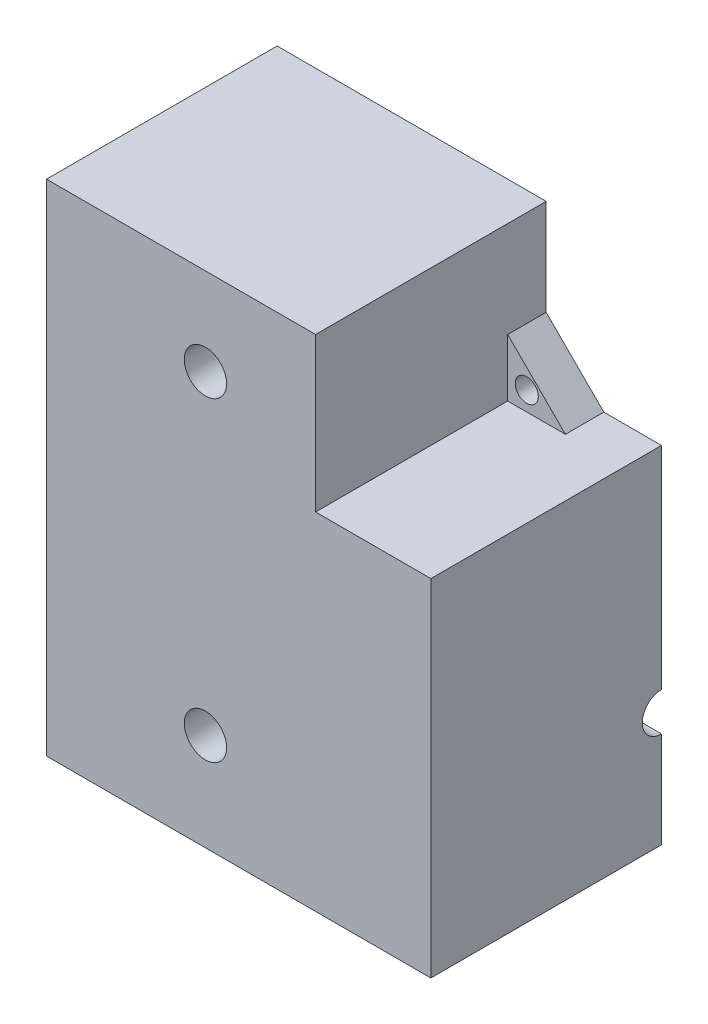
ISO-10303-21;
HEADER;
FILE_DESCRIPTION(('STEP AP214'),'2;1');
FILE_NAME('part.step','',(''),(''),'','','');
FILE_SCHEMA(('AUTOMOTIVE_DESIGN { 1 0 10303 214 1 1 1 1 }'));
ENDSEC;
DATA;
#1=APPLICATION_CONTEXT('core data for automotive mechanical design processes');
#2=APPLICATION_PROTOCOL_DEFINITION('international standard','automotive_design',2000,#1);
#3=PRODUCT_CONTEXT('',#1,'mechanical');
#4=PRODUCT('Part','Part','',(#3));
#5=PRODUCT_RELATED_PRODUCT_CATEGORY('part','',(#4));
#6=PRODUCT_DEFINITION_FORMATION('','',#4);
#7=PRODUCT_DEFINITION_CONTEXT('part definition',#1,'design');
#8=PRODUCT_DEFINITION('design','',#6,#7);
#9=PRODUCT_DEFINITION_SHAPE('','',#8);
#10=(LENGTH_UNIT() NAMED_UNIT(*) SI_UNIT(.MILLI.,.METRE.));
#11=(NAMED_UNIT(*) PLANE_ANGLE_UNIT() SI_UNIT($,.RADIAN.));
#12=(NAMED_UNIT(*) SI_UNIT($,.STERADIAN.) SOLID_ANGLE_UNIT());
#13=UNCERTAINTY_MEASURE_WITH_UNIT(LENGTH_MEASURE(1.E-05),#10,'distance_accuracy_value','');
#14=(GEOMETRIC_REPRESENTATION_CONTEXT(3) GLOBAL_UNCERTAINTY_ASSIGNED_CONTEXT((#13)) GLOBAL_UNIT_ASSIGNED_CONTEXT((#10,
#11,#12)) REPRESENTATION_CONTEXT('',''));
#15=CARTESIAN_POINT('',(0.,0.,0.));
#16=DIRECTION('',(0.,0.,1.));
#17=DIRECTION('',(1.,0.,0.));
#18=AXIS2_PLACEMENT_3D('',#15,#16,#17);
#19=CARTESIAN_POINT('',(-62.6704468378535,-90.6576669308982,5.));
#20=DIRECTION('',(0.,0.,1.));
#21=DIRECTION('',(1.,0.,0.));
#22=AXIS2_PLACEMENT_3D('',#19,#20,#21);
#23=PLANE('',#22);
#24=DIRECTION('',(0.,1.,0.));
#25=VECTOR('',#24,1.);
#26=CARTESIAN_POINT('',(-27.6704468378535,-25.6576669308982,5.));
#27=LINE('',#26,#25);
#28=CARTESIAN_POINT('',(-27.6704468378535,-45.6576669308982,5.));
#29=VERTEX_POINT('',#28);
#30=CARTESIAN_POINT('',(-27.6704468378535,-38.1576669308982,5.));
#31=VERTEX_POINT('',#30);
#32=EDGE_CURVE('E257',#29,#31,#27,.T.);
#33=ORIENTED_EDGE('',*,*,#32,.F.);
#34=DIRECTION('',(-1.,0.,0.));
#35=VECTOR('',#34,1.);
#36=CARTESIAN_POINT('',(-27.6704468378535,-45.6576669308982,5.));
#37=LINE('',#36,#35);
#38=CARTESIAN_POINT('',(-20.1704468378535,-45.6576669308982,5.));
#39=VERTEX_POINT('',#38);
#40=EDGE_CURVE('E360',#39,#29,#37,.T.);
#41=ORIENTED_EDGE('',*,*,#40,.F.);
#42=DIRECTION('',(-0.707106781186548,0.707106781186548,0.));
#43=VECTOR('',#42,1.);
#44=CARTESIAN_POINT('',(-27.6704468378535,-38.1576669308982,5.));
#45=LINE('',#44,#43);
#46=EDGE_CURVE('E217',#39,#31,#45,.T.);
#47=ORIENTED_EDGE('',*,*,#46,.T.);
#48=EDGE_LOOP('',(#33,#41,#47));
#49=FACE_BOUND('',#48,.T.);
#50=CARTESIAN_POINT('',(-25.1955731037006,-43.1827931967453,5.));
#51=DIRECTION('',(0.,0.,1.));
#52=DIRECTION('',(1.,0.,0.));
#53=AXIS2_PLACEMENT_3D('',#50,#51,#52);
#54=CIRCLE('',#53,1.5);
#55=CARTESIAN_POINT('',(-23.6955731037006,-43.1827931967453,5.));
#56=VERTEX_POINT('',#55);
#57=EDGE_CURVE('E247',#56,#56,#54,.T.);
#58=ORIENTED_EDGE('',*,*,#57,.F.);
#59=EDGE_LOOP('',(#58));
#60=FACE_BOUND('',#59,.T.);
#61=ADVANCED_FACE('F30',(#49,#60),#23,.T.);
#62=DIRECTION('',(1.,0.,0.));
#63=VECTOR('',#62,1.);
#64=CARTESIAN_POINT('',(-62.6704468378535,-90.6576669308982,5.));
#65=LINE('',#64,#63);
#66=CARTESIAN_POINT('',(-42.6704468378535,-90.6576669308982,5.));
#67=VERTEX_POINT('',#66);
#68=CARTESIAN_POINT('',(-32.6704468378535,-90.6576669308982,5.));
#69=VERTEX_POINT('',#68);
#70=EDGE_CURVE('E295',#67,#69,#65,.T.);
#71=ORIENTED_EDGE('',*,*,#70,.F.);
#72=DIRECTION('',(0.637046062357118,-0.770825735452113,0.));
#73=VECTOR('',#72,1.);
#74=CARTESIAN_POINT('',(-42.6704468378535,-90.6576669308982,5.));
#75=LINE('',#74,#73);
#76=CARTESIAN_POINT('',(-37.6704468378535,-96.7076669308982,5.));
#77=VERTEX_POINT('',#76);
#78=EDGE_CURVE('E388',#67,#77,#75,.T.);
#79=ORIENTED_EDGE('',*,*,#78,.T.);
#80=DIRECTION('',(0.637046062357118,0.770825735452113,0.));
#81=VECTOR('',#80,1.);
#82=CARTESIAN_POINT('',(-32.6704468378535,-90.6576669308982,5.));
#83=LINE('',#82,#81);
#84=EDGE_CURVE('E378',#77,#69,#83,.T.);
#85=ORIENTED_EDGE('',*,*,#84,.T.);
#86=EDGE_LOOP('',(#71,#79,#85));
#87=FACE_BOUND('',#86,.T.);
#88=CARTESIAN_POINT('',(-37.6704468378535,-93.2076669308982,5.));
#89=DIRECTION('',(0.,0.,1.));
#90=DIRECTION('',(1.,0.,0.));
#91=AXIS2_PLACEMENT_3D('',#88,#89,#90);
#92=CIRCLE('',#91,1.5);
#93=CARTESIAN_POINT('',(-36.1704468378535,-93.2076669308982,5.));
#94=VERTEX_POINT('',#93);
#95=EDGE_CURVE('E251',#94,#94,#92,.T.);
#96=ORIENTED_EDGE('',*,*,#95,.F.);
#97=EDGE_LOOP('',(#96));
#98=FACE_BOUND('',#97,.T.);
#99=ADVANCED_FACE('F436',(#87,#98),#23,.T.);
#100=CARTESIAN_POINT('',(-62.6704468378535,-53.1576669308982,5.));
#101=DIRECTION('',(0.637121756226139,-0.770763172280124,0.));
#102=DIRECTION('',(0.770763172280124,0.637121756226139,0.));
#103=AXIS2_PLACEMENT_3D('',#100,#101,#102);
#104=PLANE('',#103);
#105=DIRECTION('',(-0.770763172280124,-0.637121756226139,0.));
#106=VECTOR('',#105,1.);
#107=CARTESIAN_POINT('',(-62.6704468378535,-53.1576669308982,0.));
#108=LINE('',#107,#106);
#109=CARTESIAN_POINT('',(-62.6704468378535,-53.1576669308982,0.));
#110=VERTEX_POINT('',#109);
#111=CARTESIAN_POINT('',(-68.719237078871,-58.1576669308982,0.));
#112=VERTEX_POINT('',#111);
#113=EDGE_CURVE('E273',#110,#112,#108,.T.);
#114=ORIENTED_EDGE('',*,*,#113,.T.);
#115=DIRECTION('',(0.,0.,-1.));
#116=VECTOR('',#115,1.);
#117=CARTESIAN_POINT('',(-68.719237078871,-58.1576669308982,5.));
#118=LINE('',#117,#116);
#119=CARTESIAN_POINT('',(-68.719237078871,-58.1576669308982,5.));
#120=VERTEX_POINT('',#119);
#121=EDGE_CURVE('E235',#120,#112,#118,.T.);
#122=ORIENTED_EDGE('',*,*,#121,.F.);
#123=DIRECTION('',(-0.770763172280124,-0.637121756226139,0.));
#124=VECTOR('',#123,1.);
#125=CARTESIAN_POINT('',(-62.6704468378535,-53.1576669308982,5.));
#126=LINE('',#125,#124);
#127=CARTESIAN_POINT('',(-62.6704468378535,-53.1576669308982,5.));
#128=VERTEX_POINT('',#127);
#129=EDGE_CURVE('E212',#128,#120,#126,.T.);
#130=ORIENTED_EDGE('',*,*,#129,.F.);
#131=DIRECTION('',(0.,0.,-1.));
#132=VECTOR('',#131,1.);
#133=CARTESIAN_POINT('',(-62.6704468378535,-53.1576669308982,5.));
#134=LINE('',#133,#132);
#135=EDGE_CURVE('E238',#128,#110,#134,.T.);
#136=ORIENTED_EDGE('',*,*,#135,.T.);
#137=EDGE_LOOP('',(#114,#122,#130,#136));
#138=FACE_BOUND('',#137,.T.);
#139=ADVANCED_FACE('F32',(#138),#104,.F.);
#140=CARTESIAN_POINT('',(-68.719237078871,-58.1576669308982,5.));
#141=DIRECTION('',(0.637121756226137,0.770763172280126,0.));
#142=DIRECTION('',(-0.770763172280126,0.637121756226137,0.));
#143=AXIS2_PLACEMENT_3D('',#140,#141,#142);
#144=PLANE('',#143);
#145=DIRECTION('',(0.770763172280126,-0.637121756226137,0.));
#146=VECTOR('',#145,1.);
#147=CARTESIAN_POINT('',(-68.719237078871,-58.1576669308982,0.));
#148=LINE('',#147,#146);
#149=CARTESIAN_POINT('',(-62.6704468378535,-63.1576669308982,0.));
#150=VERTEX_POINT('',#149);
#151=EDGE_CURVE('E275',#112,#150,#148,.T.);
#152=ORIENTED_EDGE('',*,*,#151,.T.);
#153=DIRECTION('',(0.,0.,-1.));
#154=VECTOR('',#153,1.);
#155=CARTESIAN_POINT('',(-62.6704468378535,-63.1576669308982,5.));
#156=LINE('',#155,#154);
#157=CARTESIAN_POINT('',(-62.6704468378535,-63.1576669308982,5.));
#158=VERTEX_POINT('',#157);
#159=EDGE_CURVE('E234',#158,#150,#156,.T.);
#160=ORIENTED_EDGE('',*,*,#159,.F.);
#161=DIRECTION('',(0.770763172280126,-0.637121756226137,0.));
#162=VECTOR('',#161,1.);
#163=CARTESIAN_POINT('',(-68.719237078871,-58.1576669308982,5.));
#164=LINE('',#163,#162);
#165=EDGE_CURVE('E386',#120,#158,#164,.T.);
#166=ORIENTED_EDGE('',*,*,#165,.F.);
#167=ORIENTED_EDGE('',*,*,#121,.T.);
#168=EDGE_LOOP('',(#152,#160,#166,#167));
#169=FACE_BOUND('',#168,.T.);
#170=ADVANCED_FACE('F498',(#169),#144,.F.);
#171=CARTESIAN_POINT('',(-62.6704468378535,-90.6576669308982,5.));
#172=DIRECTION('',(1.,0.,0.));
#173=DIRECTION('',(0.,0.,-1.));
#174=AXIS2_PLACEMENT_3D('',#171,#172,#173);
#175=PLANE('',#174);
#176=DIRECTION('',(0.,-1.,0.));
#177=VECTOR('',#176,1.);
#178=CARTESIAN_POINT('',(-62.6704468378535,-90.6576669308982,0.));
#179=LINE('',#178,#177);
#180=CARTESIAN_POINT('',(-62.6704468378535,-90.6576669308982,0.));
#181=VERTEX_POINT('',#180);
#182=EDGE_CURVE('E277',#150,#181,#179,.T.);
#183=ORIENTED_EDGE('',*,*,#182,.T.);
#184=DIRECTION('',(0.,0.,-1.));
#185=VECTOR('',#184,1.);
#186=CARTESIAN_POINT('',(-62.6704468378535,-90.6576669308982,5.));
#187=LINE('',#186,#185);
#188=CARTESIAN_POINT('',(-62.6704468378535,-90.6576669308982,30.));
#189=VERTEX_POINT('',#188);
#190=EDGE_CURVE('E231',#189,#181,#187,.T.);
#191=ORIENTED_EDGE('',*,*,#190,.F.);
#192=DIRECTION('',(0.,-1.,0.));
#193=VECTOR('',#192,1.);
#194=CARTESIAN_POINT('',(-62.6704468378535,-25.6576669308982,30.));
#195=LINE('',#194,#193);
#196=CARTESIAN_POINT('',(-62.6704468378535,-25.6576669308982,30.));
#197=VERTEX_POINT('',#196);
#198=EDGE_CURVE('E335',#197,#189,#195,.T.);
#199=ORIENTED_EDGE('',*,*,#198,.F.);
#200=DIRECTION('',(0.,0.,-1.));
#201=VECTOR('',#200,1.);
#202=CARTESIAN_POINT('',(-62.6704468378535,-25.6576669308982,5.));
#203=LINE('',#202,#201);
#204=CARTESIAN_POINT('',(-62.6704468378535,-25.6576669308982,0.));
#205=VERTEX_POINT('',#204);
#206=EDGE_CURVE('E213',#197,#205,#203,.T.);
#207=ORIENTED_EDGE('',*,*,#206,.T.);
#208=DIRECTION('',(0.,-1.,0.));
#209=VECTOR('',#208,1.);
#210=CARTESIAN_POINT('',(-62.6704468378535,-25.6576669308982,0.));
#211=LINE('',#210,#209);
#212=EDGE_CURVE('E242',#205,#110,#211,.T.);
#213=ORIENTED_EDGE('',*,*,#212,.T.);
#214=ORIENTED_EDGE('',*,*,#135,.F.);
#215=DIRECTION('',(0.,-1.,0.));
#216=VECTOR('',#215,1.);
#217=CARTESIAN_POINT('',(-62.6704468378535,-25.6576669308982,5.));
#218=LINE('',#217,#216);
#219=EDGE_CURVE('E369',#128,#158,#218,.T.);
#220=ORIENTED_EDGE('',*,*,#219,.T.);
#221=ORIENTED_EDGE('',*,*,#159,.T.);
#222=EDGE_LOOP('',(#183,#191,#199,#207,#213,#214,#220,#221));
#223=FACE_BOUND('',#222,.T.);
#224=ADVANCED_FACE('F413',(#223),#175,.F.);
#225=CARTESIAN_POINT('',(-42.6704468378535,-90.6576669308982,5.));
#226=DIRECTION('',(0.770825735452113,0.637046062357118,0.));
#227=DIRECTION('',(-0.637046062357118,0.770825735452113,0.));
#228=AXIS2_PLACEMENT_3D('',#225,#226,#227);
#229=PLANE('',#228);
#230=DIRECTION('',(0.637046062357118,-0.770825735452113,0.));
#231=VECTOR('',#230,1.);
#232=CARTESIAN_POINT('',(-42.6704468378535,-90.6576669308982,0.));
#233=LINE('',#232,#231);
#234=CARTESIAN_POINT('',(-42.6704468378535,-90.6576669308982,0.));
#235=VERTEX_POINT('',#234);
#236=CARTESIAN_POINT('',(-37.6704468378535,-96.7076669308982,0.));
#237=VERTEX_POINT('',#236);
#238=EDGE_CURVE('E281',#235,#237,#233,.T.);
#239=ORIENTED_EDGE('',*,*,#238,.T.);
#240=DIRECTION('',(0.,0.,-1.));
#241=VECTOR('',#240,1.);
#242=CARTESIAN_POINT('',(-37.6704468378535,-96.7076669308982,5.));
#243=LINE('',#242,#241);
#244=EDGE_CURVE('E227',#77,#237,#243,.T.);
#245=ORIENTED_EDGE('',*,*,#244,.F.);
#246=ORIENTED_EDGE('',*,*,#78,.F.);
#247=DIRECTION('',(0.,0.,-1.));
#248=VECTOR('',#247,1.);
#249=CARTESIAN_POINT('',(-42.6704468378535,-90.6576669308982,5.));
#250=LINE('',#249,#248);
#251=EDGE_CURVE('E230',#67,#235,#250,.T.);
#252=ORIENTED_EDGE('',*,*,#251,.T.);
#253=EDGE_LOOP('',(#239,#245,#246,#252));
#254=FACE_BOUND('',#253,.T.);
#255=ADVANCED_FACE('F516',(#254),#229,.F.);
#256=CARTESIAN_POINT('',(-32.6704468378535,-90.6576669308982,5.));
#257=DIRECTION('',(-0.770825735452113,0.637046062357118,0.));
#258=DIRECTION('',(-0.637046062357118,-0.770825735452113,0.));
#259=AXIS2_PLACEMENT_3D('',#256,#257,#258);
#260=PLANE('',#259);
#261=DIRECTION('',(0.637046062357118,0.770825735452113,0.));
#262=VECTOR('',#261,1.);
#263=CARTESIAN_POINT('',(-32.6704468378535,-90.6576669308982,0.));
#264=LINE('',#263,#262);
#265=CARTESIAN_POINT('',(-32.6704468378535,-90.6576669308982,0.));
#266=VERTEX_POINT('',#265);
#267=EDGE_CURVE('E201',#237,#266,#264,.T.);
#268=ORIENTED_EDGE('',*,*,#267,.T.);
#269=DIRECTION('',(0.,0.,-1.));
#270=VECTOR('',#269,1.);
#271=CARTESIAN_POINT('',(-32.6704468378535,-90.6576669308982,5.));
#272=LINE('',#271,#270);
#273=EDGE_CURVE('E226',#69,#266,#272,.T.);
#274=ORIENTED_EDGE('',*,*,#273,.F.);
#275=ORIENTED_EDGE('',*,*,#84,.F.);
#276=ORIENTED_EDGE('',*,*,#244,.T.);
#277=EDGE_LOOP('',(#268,#274,#275,#276));
#278=FACE_BOUND('',#277,.T.);
#279=ADVANCED_FACE('F286',(#278),#260,.F.);
#280=CARTESIAN_POINT('',(-12.6704468378535,-90.6576669308982,5.));
#281=DIRECTION('',(0.,1.,0.));
#282=DIRECTION('',(0.,0.,1.));
#283=AXIS2_PLACEMENT_3D('',#280,#281,#282);
#284=PLANE('',#283);
#285=DIRECTION('',(1.,0.,0.));
#286=VECTOR('',#285,1.);
#287=CARTESIAN_POINT('',(-12.6704468378535,-90.6576669308982,0.));
#288=LINE('',#287,#286);
#289=CARTESIAN_POINT('',(-12.6704468378535,-90.6576669308982,0.));
#290=VERTEX_POINT('',#289);
#291=EDGE_CURVE('E199',#266,#290,#288,.T.);
#292=ORIENTED_EDGE('',*,*,#291,.T.);
#293=DIRECTION('',(0.,0.,-1.));
#294=VECTOR('',#293,1.);
#295=CARTESIAN_POINT('',(-12.6704468378535,-90.6576669308982,5.));
#296=LINE('',#295,#294);
#297=CARTESIAN_POINT('',(-12.6704468378535,-90.6576669308982,30.));
#298=VERTEX_POINT('',#297);
#299=EDGE_CURVE('E223',#298,#290,#296,.T.);
#300=ORIENTED_EDGE('',*,*,#299,.F.);
#301=DIRECTION('',(1.,0.,0.));
#302=VECTOR('',#301,1.);
#303=CARTESIAN_POINT('',(-62.6704468378535,-90.6576669308982,30.));
#304=LINE('',#303,#302);
#305=EDGE_CURVE('E338',#189,#298,#304,.T.);
#306=ORIENTED_EDGE('',*,*,#305,.F.);
#307=ORIENTED_EDGE('',*,*,#190,.T.);
#308=DIRECTION('',(1.,0.,0.));
#309=VECTOR('',#308,1.);
#310=CARTESIAN_POINT('',(-62.6704468378535,-90.6576669308982,0.));
#311=LINE('',#310,#309);
#312=EDGE_CURVE('E279',#181,#235,#311,.T.);
#313=ORIENTED_EDGE('',*,*,#312,.T.);
#314=ORIENTED_EDGE('',*,*,#251,.F.);
#315=ORIENTED_EDGE('',*,*,#70,.T.);
#316=ORIENTED_EDGE('',*,*,#273,.T.);
#317=EDGE_LOOP('',(#292,#300,#306,#307,#313,#314,#315,#316));
#318=FACE_BOUND('',#317,.T.);
#319=ADVANCED_FACE('F293',(#318),#284,.F.);
#320=CARTESIAN_POINT('',(-12.6704468378535,-90.6576669308982,5.));
#321=DIRECTION('',(-1.,0.,0.));
#322=DIRECTION('',(0.,0.,1.));
#323=AXIS2_PLACEMENT_3D('',#320,#321,#322);
#324=PLANE('',#323);
#325=DIRECTION('',(0.,1.,0.));
#326=VECTOR('',#325,1.);
#327=CARTESIAN_POINT('',(-12.6704468378535,-90.6576669308982,0.));
#328=LINE('',#327,#326);
#329=CARTESIAN_POINT('',(-12.6704468378535,-78.15766693,0.));
#330=VERTEX_POINT('',#329);
#331=EDGE_CURVE('E191',#290,#330,#328,.T.);
#332=ORIENTED_EDGE('',*,*,#331,.T.);
#333=CARTESIAN_POINT('',(-12.6704468378535,-75.65766693,0.));
#334=DIRECTION('',(1.,0.,0.));
#335=DIRECTION('',(0.,0.,-1.));
#336=AXIS2_PLACEMENT_3D('',#333,#334,#335);
#337=CIRCLE('',#336,2.5);
#338=CARTESIAN_POINT('',(-12.6704468378535,-73.15766693,0.));
#339=VERTEX_POINT('',#338);
#340=EDGE_CURVE('E179',#339,#330,#337,.T.);
#341=ORIENTED_EDGE('',*,*,#340,.F.);
#342=CARTESIAN_POINT('',(-12.6704468378535,-45.6576669308982,0.));
#343=VERTEX_POINT('',#342);
#344=EDGE_CURVE('E187',#339,#343,#328,.T.);
#345=ORIENTED_EDGE('',*,*,#344,.T.);
#346=DIRECTION('',(0.,0.,-1.));
#347=VECTOR('',#346,1.);
#348=CARTESIAN_POINT('',(-12.6704468378535,-45.6576669308982,5.));
#349=LINE('',#348,#347);
#350=CARTESIAN_POINT('',(-12.6704468378535,-45.6576669308982,30.));
#351=VERTEX_POINT('',#350);
#352=EDGE_CURVE('E221',#351,#343,#349,.T.);
#353=ORIENTED_EDGE('',*,*,#352,.F.);
#354=DIRECTION('',(0.,1.,0.));
#355=VECTOR('',#354,1.);
#356=CARTESIAN_POINT('',(-12.6704468378535,-90.6576669308982,30.));
#357=LINE('',#356,#355);
#358=EDGE_CURVE('E341',#298,#351,#357,.T.);
#359=ORIENTED_EDGE('',*,*,#358,.F.);
#360=ORIENTED_EDGE('',*,*,#299,.T.);
#361=EDGE_LOOP('',(#332,#341,#345,#353,#359,#360));
#362=FACE_BOUND('',#361,.T.);
#363=ADVANCED_FACE('F186',(#362),#324,.F.);
#364=CARTESIAN_POINT('',(-12.6704468378535,-45.6576669308982,5.));
#365=DIRECTION('',(0.,-1.,0.));
#366=DIRECTION('',(1.,0.,0.));
#367=AXIS2_PLACEMENT_3D('',#364,#365,#366);
#368=PLANE('',#367);
#369=DIRECTION('',(-1.,0.,0.));
#370=VECTOR('',#369,1.);
#371=CARTESIAN_POINT('',(-12.6704468378535,-45.6576669308982,0.));
#372=LINE('',#371,#370);
#373=CARTESIAN_POINT('',(-20.1704468378535,-45.6576669308982,0.));
#374=VERTEX_POINT('',#373);
#375=EDGE_CURVE('E198',#343,#374,#372,.T.);
#376=ORIENTED_EDGE('',*,*,#375,.T.);
#377=DIRECTION('',(0.,0.,-1.));
#378=VECTOR('',#377,1.);
#379=CARTESIAN_POINT('',(-20.1704468378535,-45.6576669308982,5.));
#380=LINE('',#379,#378);
#381=EDGE_CURVE('E224',#39,#374,#380,.T.);
#382=ORIENTED_EDGE('',*,*,#381,.F.);
#383=ORIENTED_EDGE('',*,*,#40,.T.);
#384=DIRECTION('',(0.,0.,-1.));
#385=VECTOR('',#384,1.);
#386=CARTESIAN_POINT('',(-27.6704468378535,-45.6576669308982,30.));
#387=LINE('',#386,#385);
#388=CARTESIAN_POINT('',(-27.6704468378535,-45.6576669308982,30.));
#389=VERTEX_POINT('',#388);
#390=EDGE_CURVE('E263',#389,#29,#387,.T.);
#391=ORIENTED_EDGE('',*,*,#390,.F.);
#392=DIRECTION('',(-1.,0.,0.));
#393=VECTOR('',#392,1.);
#394=CARTESIAN_POINT('',(-27.6704468378535,-45.6576669308982,30.));
#395=LINE('',#394,#393);
#396=EDGE_CURVE('E344',#351,#389,#395,.T.);
#397=ORIENTED_EDGE('',*,*,#396,.F.);
#398=ORIENTED_EDGE('',*,*,#352,.T.);
#399=EDGE_LOOP('',(#376,#382,#383,#391,#397,#398));
#400=FACE_BOUND('',#399,.T.);
#401=ADVANCED_FACE('F358',(#400),#368,.F.);
#402=CARTESIAN_POINT('',(-27.6704468378535,-38.1576669308982,5.));
#403=DIRECTION('',(-0.707106781186548,-0.707106781186548,0.));
#404=DIRECTION('',(0.707106781186548,-0.707106781186548,0.));
#405=AXIS2_PLACEMENT_3D('',#402,#403,#404);
#406=PLANE('',#405);
#407=DIRECTION('',(-0.707106781186548,0.707106781186548,0.));
#408=VECTOR('',#407,1.);
#409=CARTESIAN_POINT('',(-27.6704468378535,-38.1576669308982,0.));
#410=LINE('',#409,#408);
#411=CARTESIAN_POINT('',(-27.6704468378535,-38.1576669308982,0.));
#412=VERTEX_POINT('',#411);
#413=EDGE_CURVE('E206',#374,#412,#410,.T.);
#414=ORIENTED_EDGE('',*,*,#413,.T.);
#415=DIRECTION('',(0.,0.,-1.));
#416=VECTOR('',#415,1.);
#417=CARTESIAN_POINT('',(-27.6704468378535,-38.1576669308982,5.));
#418=LINE('',#417,#416);
#419=EDGE_CURVE('E220',#31,#412,#418,.T.);
#420=ORIENTED_EDGE('',*,*,#419,.F.);
#421=ORIENTED_EDGE('',*,*,#46,.F.);
#422=ORIENTED_EDGE('',*,*,#381,.T.);
#423=EDGE_LOOP('',(#414,#420,#421,#422));
#424=FACE_BOUND('',#423,.T.);
#425=ADVANCED_FACE('F554',(#424),#406,.F.);
#426=CARTESIAN_POINT('',(-27.6704468378535,-25.6576669308982,5.));
#427=DIRECTION('',(-1.,0.,0.));
#428=DIRECTION('',(0.,-1.,0.));
#429=AXIS2_PLACEMENT_3D('',#426,#427,#428);
#430=PLANE('',#429);
#431=DIRECTION('',(0.,1.,0.));
#432=VECTOR('',#431,1.);
#433=CARTESIAN_POINT('',(-27.6704468378535,-25.6576669308982,0.));
#434=LINE('',#433,#432);
#435=CARTESIAN_POINT('',(-27.6704468378535,-25.6576669308982,0.));
#436=VERTEX_POINT('',#435);
#437=EDGE_CURVE('E208',#412,#436,#434,.T.);
#438=ORIENTED_EDGE('',*,*,#437,.T.);
#439=DIRECTION('',(0.,0.,-1.));
#440=VECTOR('',#439,1.);
#441=CARTESIAN_POINT('',(-27.6704468378535,-25.6576669308982,5.));
#442=LINE('',#441,#440);
#443=CARTESIAN_POINT('',(-27.6704468378535,-25.6576669308982,30.));
#444=VERTEX_POINT('',#443);
#445=EDGE_CURVE('E216',#444,#436,#442,.T.);
#446=ORIENTED_EDGE('',*,*,#445,.F.);
#447=DIRECTION('',(0.,1.,0.));
#448=VECTOR('',#447,1.);
#449=CARTESIAN_POINT('',(-27.6704468378535,-25.6576669308982,30.));
#450=LINE('',#449,#448);
#451=EDGE_CURVE('E345',#389,#444,#450,.T.);
#452=ORIENTED_EDGE('',*,*,#451,.F.);
#453=ORIENTED_EDGE('',*,*,#390,.T.);
#454=ORIENTED_EDGE('',*,*,#32,.T.);
#455=ORIENTED_EDGE('',*,*,#419,.T.);
#456=EDGE_LOOP('',(#438,#446,#452,#453,#454,#455));
#457=FACE_BOUND('',#456,.T.);
#458=ADVANCED_FACE('F353',(#457),#430,.F.);
#459=CARTESIAN_POINT('',(-62.6704468378535,-25.6576669308982,5.));
#460=DIRECTION('',(0.,-1.,0.));
#461=DIRECTION('',(0.,0.,-1.));
#462=AXIS2_PLACEMENT_3D('',#459,#460,#461);
#463=PLANE('',#462);
#464=DIRECTION('',(-1.,0.,0.));
#465=VECTOR('',#464,1.);
#466=CARTESIAN_POINT('',(-62.6704468378535,-25.6576669308982,0.));
#467=LINE('',#466,#465);
#468=EDGE_CURVE('E210',#436,#205,#467,.T.);
#469=ORIENTED_EDGE('',*,*,#468,.T.);
#470=ORIENTED_EDGE('',*,*,#206,.F.);
#471=DIRECTION('',(-1.,0.,0.));
#472=VECTOR('',#471,1.);
#473=CARTESIAN_POINT('',(-62.6704468378535,-25.6576669308982,30.));
#474=LINE('',#473,#472);
#475=EDGE_CURVE('E261',#444,#197,#474,.T.);
#476=ORIENTED_EDGE('',*,*,#475,.F.);
#477=ORIENTED_EDGE('',*,*,#445,.T.);
#478=EDGE_LOOP('',(#469,#470,#476,#477));
#479=FACE_BOUND('',#478,.T.);
#480=ADVANCED_FACE('F410',(#479),#463,.F.);
#481=ORIENTED_EDGE('',*,*,#219,.F.);
#482=ORIENTED_EDGE('',*,*,#129,.T.);
#483=ORIENTED_EDGE('',*,*,#165,.T.);
#484=EDGE_LOOP('',(#481,#482,#483));
#485=FACE_BOUND('',#484,.T.);
#486=CARTESIAN_POINT('',(-65.219237078871,-58.1576669308982,5.));
#487=DIRECTION('',(0.,0.,1.));
#488=DIRECTION('',(1.,0.,0.));
#489=AXIS2_PLACEMENT_3D('',#486,#487,#488);
#490=CIRCLE('',#489,1.5);
#491=CARTESIAN_POINT('',(-63.719237078871,-58.1576669308982,5.));
#492=VERTEX_POINT('',#491);
#493=EDGE_CURVE('E243',#492,#492,#490,.T.);
#494=ORIENTED_EDGE('',*,*,#493,.F.);
#495=EDGE_LOOP('',(#494));
#496=FACE_BOUND('',#495,.T.);
#497=ADVANCED_FACE('F438',(#485,#496),#23,.T.);
#498=CARTESIAN_POINT('',(-62.6704468378535,-90.6576669308982,0.));
#499=DIRECTION('',(0.,0.,1.));
#500=DIRECTION('',(1.,0.,0.));
#501=AXIS2_PLACEMENT_3D('',#498,#499,#500);
#502=PLANE('',#501);
#503=CARTESIAN_POINT('',(-37.6704468378535,-93.2076669308982,0.));
#504=DIRECTION('',(0.,0.,1.));
#505=DIRECTION('',(1.,0.,0.));
#506=AXIS2_PLACEMENT_3D('',#503,#504,#505);
#507=CIRCLE('',#506,1.5);
#508=CARTESIAN_POINT('',(-36.1704468378535,-93.2076669308982,0.));
#509=VERTEX_POINT('',#508);
#510=EDGE_CURVE('E248',#509,#509,#507,.T.);
#511=ORIENTED_EDGE('',*,*,#510,.T.);
#512=EDGE_LOOP('',(#511));
#513=FACE_BOUND('',#512,.T.);
#514=CARTESIAN_POINT('',(-25.1955731037006,-43.1827931967453,0.));
#515=DIRECTION('',(0.,0.,1.));
#516=DIRECTION('',(1.,0.,0.));
#517=AXIS2_PLACEMENT_3D('',#514,#515,#516);
#518=CIRCLE('',#517,1.5);
#519=CARTESIAN_POINT('',(-23.6955731037006,-43.1827931967453,0.));
#520=VERTEX_POINT('',#519);
#521=EDGE_CURVE('E244',#520,#520,#518,.T.);
#522=ORIENTED_EDGE('',*,*,#521,.T.);
#523=EDGE_LOOP('',(#522));
#524=FACE_BOUND('',#523,.T.);
#525=CARTESIAN_POINT('',(-65.219237078871,-58.1576669308982,0.));
#526=DIRECTION('',(0.,0.,1.));
#527=DIRECTION('',(1.,0.,0.));
#528=AXIS2_PLACEMENT_3D('',#525,#526,#527);
#529=CIRCLE('',#528,1.5);
#530=CARTESIAN_POINT('',(-63.719237078871,-58.1576669308982,0.));
#531=VERTEX_POINT('',#530);
#532=EDGE_CURVE('E239',#531,#531,#529,.T.);
#533=ORIENTED_EDGE('',*,*,#532,.T.);
#534=EDGE_LOOP('',(#533));
#535=FACE_BOUND('',#534,.T.);
#536=DIRECTION('',(0.,1.,0.));
#537=VECTOR('',#536,1.);
#538=CARTESIAN_POINT('',(-17.6704468378535,-90.6576669308982,0.));
#539=LINE('',#538,#537);
#540=CARTESIAN_POINT('',(-17.6704468378535,-85.6576669308982,0.));
#541=VERTEX_POINT('',#540);
#542=CARTESIAN_POINT('',(-17.6704468378535,-78.15766693,0.));
#543=VERTEX_POINT('',#542);
#544=EDGE_CURVE('E298',#541,#543,#539,.T.);
#545=ORIENTED_EDGE('',*,*,#544,.T.);
#546=DIRECTION('',(1.,0.,0.));
#547=VECTOR('',#546,1.);
#548=CARTESIAN_POINT('',(-22.6704468378535,-78.15766693,0.));
#549=LINE('',#548,#547);
#550=EDGE_CURVE('E45',#543,#330,#549,.T.);
#551=ORIENTED_EDGE('',*,*,#550,.T.);
#552=ORIENTED_EDGE('',*,*,#331,.F.);
#553=ORIENTED_EDGE('',*,*,#291,.F.);
#554=ORIENTED_EDGE('',*,*,#267,.F.);
#555=ORIENTED_EDGE('',*,*,#238,.F.);
#556=ORIENTED_EDGE('',*,*,#312,.F.);
#557=ORIENTED_EDGE('',*,*,#182,.F.);
#558=ORIENTED_EDGE('',*,*,#151,.F.);
#559=ORIENTED_EDGE('',*,*,#113,.F.);
#560=ORIENTED_EDGE('',*,*,#212,.F.);
#561=ORIENTED_EDGE('',*,*,#468,.F.);
#562=ORIENTED_EDGE('',*,*,#437,.F.);
#563=ORIENTED_EDGE('',*,*,#413,.F.);
#564=ORIENTED_EDGE('',*,*,#375,.F.);
#565=ORIENTED_EDGE('',*,*,#344,.F.);
#566=DIRECTION('',(1.,0.,0.));
#567=VECTOR('',#566,1.);
#568=CARTESIAN_POINT('',(-22.6704468378535,-73.15766693,0.));
#569=LINE('',#568,#567);
#570=CARTESIAN_POINT('',(-17.6704468378535,-73.15766693,0.));
#571=VERTEX_POINT('',#570);
#572=EDGE_CURVE('E176',#339,#571,#569,.F.);
#573=ORIENTED_EDGE('',*,*,#572,.T.);
#574=CARTESIAN_POINT('',(-17.6704468378535,-50.6576669308982,0.));
#575=VERTEX_POINT('',#574);
#576=EDGE_CURVE('E735',#571,#575,#539,.T.);
#577=ORIENTED_EDGE('',*,*,#576,.T.);
#578=DIRECTION('',(-1.,0.,0.));
#579=VECTOR('',#578,1.);
#580=CARTESIAN_POINT('',(-62.6704468378535,-50.6576669308982,0.));
#581=LINE('',#580,#579);
#582=CARTESIAN_POINT('',(-32.6704468378535,-50.6576669308982,0.));
#583=VERTEX_POINT('',#582);
#584=EDGE_CURVE('E38',#575,#583,#581,.T.);
#585=ORIENTED_EDGE('',*,*,#584,.T.);
#586=DIRECTION('',(0.,1.,0.));
#587=VECTOR('',#586,1.);
#588=CARTESIAN_POINT('',(-32.6704468378535,-90.6576669308982,0.));
#589=LINE('',#588,#587);
#590=CARTESIAN_POINT('',(-32.6704468378535,-30.6576669308982,0.));
#591=VERTEX_POINT('',#590);
#592=EDGE_CURVE('E364',#583,#591,#589,.T.);
#593=ORIENTED_EDGE('',*,*,#592,.T.);
#594=DIRECTION('',(-1.,0.,0.));
#595=VECTOR('',#594,1.);
#596=CARTESIAN_POINT('',(-62.6704468378535,-30.6576669308982,0.));
#597=LINE('',#596,#595);
#598=CARTESIAN_POINT('',(-57.6704468378535,-30.6576669308982,0.));
#599=VERTEX_POINT('',#598);
#600=EDGE_CURVE('E367',#591,#599,#597,.T.);
#601=ORIENTED_EDGE('',*,*,#600,.T.);
#602=DIRECTION('',(0.,-1.,0.));
#603=VECTOR('',#602,1.);
#604=CARTESIAN_POINT('',(-57.6704468378535,-90.6576669308982,0.));
#605=LINE('',#604,#603);
#606=CARTESIAN_POINT('',(-57.6704468378535,-85.6576669308982,0.));
#607=VERTEX_POINT('',#606);
#608=EDGE_CURVE('E728',#599,#607,#605,.T.);
#609=ORIENTED_EDGE('',*,*,#608,.T.);
#610=DIRECTION('',(1.,0.,0.));
#611=VECTOR('',#610,1.);
#612=CARTESIAN_POINT('',(-62.6704468378535,-85.6576669308982,0.));
#613=LINE('',#612,#611);
#614=EDGE_CURVE('E725',#607,#541,#613,.T.);
#615=ORIENTED_EDGE('',*,*,#614,.T.);
#616=EDGE_LOOP('',(#545,#551,#552,#553,#554,#555,#556,#557,#558,#559,#560,#561,#562,#563,#564,
#565,#573,#577,#585,#593,#601,#609,#615));
#617=FACE_BOUND('',#616,.T.);
#618=ADVANCED_FACE('F196',(#513,#524,#535,#617),#502,.F.);
#619=CARTESIAN_POINT('',(-65.219237078871,-58.1576669308982,-5.));
#620=DIRECTION('',(0.,0.,1.));
#621=DIRECTION('',(1.,0.,0.));
#622=AXIS2_PLACEMENT_3D('',#619,#620,#621);
#623=CYLINDRICAL_SURFACE('',#622,1.5);
#624=ORIENTED_EDGE('',*,*,#493,.T.);
#625=EDGE_LOOP('',(#624));
#626=FACE_BOUND('',#625,.T.);
#627=ORIENTED_EDGE('',*,*,#532,.F.);
#628=EDGE_LOOP('',(#627));
#629=FACE_BOUND('',#628,.T.);
#630=ADVANCED_FACE('F452',(#626,#629),#623,.F.);
#631=CARTESIAN_POINT('',(-25.1955731037006,-43.1827931967453,-5.));
#632=DIRECTION('',(0.,0.,1.));
#633=DIRECTION('',(1.,0.,0.));
#634=AXIS2_PLACEMENT_3D('',#631,#632,#633);
#635=CYLINDRICAL_SURFACE('',#634,1.5);
#636=ORIENTED_EDGE('',*,*,#57,.T.);
#637=EDGE_LOOP('',(#636));
#638=FACE_BOUND('',#637,.T.);
#639=ORIENTED_EDGE('',*,*,#521,.F.);
#640=EDGE_LOOP('',(#639));
#641=FACE_BOUND('',#640,.T.);
#642=ADVANCED_FACE('F429',(#638,#641),#635,.F.);
#643=CARTESIAN_POINT('',(-37.6704468378535,-93.2076669308982,-5.));
#644=DIRECTION('',(0.,0.,1.));
#645=DIRECTION('',(1.,0.,0.));
#646=AXIS2_PLACEMENT_3D('',#643,#644,#645);
#647=CYLINDRICAL_SURFACE('',#646,1.5);
#648=ORIENTED_EDGE('',*,*,#95,.T.);
#649=EDGE_LOOP('',(#648));
#650=FACE_BOUND('',#649,.T.);
#651=ORIENTED_EDGE('',*,*,#510,.F.);
#652=EDGE_LOOP('',(#651));
#653=FACE_BOUND('',#652,.T.);
#654=ADVANCED_FACE('F419',(#650,#653),#647,.F.);
#655=CARTESIAN_POINT('',(-12.6704468378535,-25.6576669308983,30.));
#656=DIRECTION('',(0.,0.,1.));
#657=DIRECTION('',(1.,0.,0.));
#658=AXIS2_PLACEMENT_3D('',#655,#656,#657);
#659=PLANE('',#658);
#660=CARTESIAN_POINT('',(-42.,-37.,30.));
#661=DIRECTION('',(0.,0.,1.));
#662=DIRECTION('',(1.,0.,0.));
#663=AXIS2_PLACEMENT_3D('',#660,#661,#662);
#664=CIRCLE('',#663,2.75);
#665=CARTESIAN_POINT('',(-39.25,-37.,30.));
#666=VERTEX_POINT('',#665);
#667=EDGE_CURVE('E192',#666,#666,#664,.T.);
#668=ORIENTED_EDGE('',*,*,#667,.F.);
#669=EDGE_LOOP('',(#668));
#670=FACE_BOUND('',#669,.T.);
#671=CARTESIAN_POINT('',(-42.,-78.,30.));
#672=DIRECTION('',(0.,0.,1.));
#673=DIRECTION('',(1.,0.,0.));
#674=AXIS2_PLACEMENT_3D('',#671,#672,#673);
#675=CIRCLE('',#674,2.75);
#676=CARTESIAN_POINT('',(-39.25,-78.,30.));
#677=VERTEX_POINT('',#676);
#678=EDGE_CURVE('E299',#677,#677,#675,.T.);
#679=ORIENTED_EDGE('',*,*,#678,.F.);
#680=EDGE_LOOP('',(#679));
#681=FACE_BOUND('',#680,.T.);
#682=ORIENTED_EDGE('',*,*,#475,.T.);
#683=ORIENTED_EDGE('',*,*,#198,.T.);
#684=ORIENTED_EDGE('',*,*,#305,.T.);
#685=ORIENTED_EDGE('',*,*,#358,.T.);
#686=ORIENTED_EDGE('',*,*,#396,.T.);
#687=ORIENTED_EDGE('',*,*,#451,.T.);
#688=EDGE_LOOP('',(#682,#683,#684,#685,#686,#687));
#689=FACE_BOUND('',#688,.T.);
#690=ADVANCED_FACE('F416',(#670,#681,#689),#659,.T.);
#691=CARTESIAN_POINT('',(-17.6704468378535,-50.6576669308982,-15.));
#692=DIRECTION('',(0.,1.,0.));
#693=DIRECTION('',(0.,0.,1.));
#694=AXIS2_PLACEMENT_3D('',#691,#692,#693);
#695=PLANE('',#694);
#696=DIRECTION('',(0.,0.,1.));
#697=VECTOR('',#696,1.);
#698=CARTESIAN_POINT('',(-17.6704468378535,-50.6576669308982,-15.));
#699=LINE('',#698,#697);
#700=CARTESIAN_POINT('',(-17.6704468378535,-50.6576669308982,25.));
#701=VERTEX_POINT('',#700);
#702=EDGE_CURVE('E262',#575,#701,#699,.T.);
#703=ORIENTED_EDGE('',*,*,#702,.T.);
#704=DIRECTION('',(1.,0.,0.));
#705=VECTOR('',#704,1.);
#706=CARTESIAN_POINT('',(-17.6704468378535,-50.6576669308982,25.));
#707=LINE('',#706,#705);
#708=CARTESIAN_POINT('',(-32.6704468378535,-50.6576669308982,25.));
#709=VERTEX_POINT('',#708);
#710=EDGE_CURVE('E308',#709,#701,#707,.T.);
#711=ORIENTED_EDGE('',*,*,#710,.F.);
#712=DIRECTION('',(0.,0.,1.));
#713=VECTOR('',#712,1.);
#714=CARTESIAN_POINT('',(-32.6704468378535,-50.6576669308982,-15.));
#715=LINE('',#714,#713);
#716=EDGE_CURVE('E323',#583,#709,#715,.T.);
#717=ORIENTED_EDGE('',*,*,#716,.F.);
#718=ORIENTED_EDGE('',*,*,#584,.F.);
#719=EDGE_LOOP('',(#703,#711,#717,#718));
#720=FACE_BOUND('',#719,.T.);
#721=ADVANCED_FACE('F418',(#720),#695,.F.);
#722=CARTESIAN_POINT('',(-17.6704468378535,-85.6576669308982,-15.));
#723=DIRECTION('',(1.,0.,0.));
#724=DIRECTION('',(0.,0.,-1.));
#725=AXIS2_PLACEMENT_3D('',#722,#723,#724);
#726=PLANE('',#725);
#727=ORIENTED_EDGE('',*,*,#576,.F.);
#728=CARTESIAN_POINT('',(-17.6704468378535,-75.65766693,0.));
#729=DIRECTION('',(1.,0.,0.));
#730=DIRECTION('',(0.,0.,-1.));
#731=AXIS2_PLACEMENT_3D('',#728,#729,#730);
#732=CIRCLE('',#731,2.5);
#733=EDGE_CURVE('E11',#571,#543,#732,.T.);
#734=ORIENTED_EDGE('',*,*,#733,.T.);
#735=ORIENTED_EDGE('',*,*,#544,.F.);
#736=DIRECTION('',(0.,0.,1.));
#737=VECTOR('',#736,1.);
#738=CARTESIAN_POINT('',(-17.6704468378535,-85.6576669308982,-15.));
#739=LINE('',#738,#737);
#740=CARTESIAN_POINT('',(-17.6704468378535,-85.6576669308982,25.));
#741=VERTEX_POINT('',#740);
#742=EDGE_CURVE('E325',#541,#741,#739,.T.);
#743=ORIENTED_EDGE('',*,*,#742,.T.);
#744=DIRECTION('',(0.,-1.,0.));
#745=VECTOR('',#744,1.);
#746=CARTESIAN_POINT('',(-17.6704468378535,-85.6576669308982,25.));
#747=LINE('',#746,#745);
#748=EDGE_CURVE('E311',#701,#741,#747,.T.);
#749=ORIENTED_EDGE('',*,*,#748,.F.);
#750=ORIENTED_EDGE('',*,*,#702,.F.);
#751=EDGE_LOOP('',(#727,#734,#735,#743,#749,#750));
#752=FACE_BOUND('',#751,.T.);
#753=ADVANCED_FACE('F426',(#752),#726,.F.);
#754=CARTESIAN_POINT('',(-35.0247658554327,-85.6576669308982,-15.));
#755=DIRECTION('',(0.,-1.,0.));
#756=DIRECTION('',(0.,0.,-1.));
#757=AXIS2_PLACEMENT_3D('',#754,#755,#756);
#758=PLANE('',#757);
#759=DIRECTION('',(0.,0.,1.));
#760=VECTOR('',#759,1.);
#761=CARTESIAN_POINT('',(-57.6704468378535,-85.6576669308982,-15.));
#762=LINE('',#761,#760);
#763=CARTESIAN_POINT('',(-57.6704468378535,-85.6576669308982,25.));
#764=VERTEX_POINT('',#763);
#765=EDGE_CURVE('E327',#607,#764,#762,.T.);
#766=ORIENTED_EDGE('',*,*,#765,.T.);
#767=DIRECTION('',(-1.,0.,0.));
#768=VECTOR('',#767,1.);
#769=CARTESIAN_POINT('',(-57.6704468378535,-85.6576669308982,25.));
#770=LINE('',#769,#768);
#771=EDGE_CURVE('E314',#741,#764,#770,.T.);
#772=ORIENTED_EDGE('',*,*,#771,.F.);
#773=ORIENTED_EDGE('',*,*,#742,.F.);
#774=ORIENTED_EDGE('',*,*,#614,.F.);
#775=EDGE_LOOP('',(#766,#772,#773,#774));
#776=FACE_BOUND('',#775,.T.);
#777=ADVANCED_FACE('F600',(#776),#758,.F.);
#778=CARTESIAN_POINT('',(-57.6704468378535,-60.8036478442028,-15.));
#779=DIRECTION('',(-1.,0.,0.));
#780=DIRECTION('',(0.,0.,1.));
#781=AXIS2_PLACEMENT_3D('',#778,#779,#780);
#782=PLANE('',#781);
#783=DIRECTION('',(0.,0.,1.));
#784=VECTOR('',#783,1.);
#785=CARTESIAN_POINT('',(-57.6704468378535,-30.6576669308982,-15.));
#786=LINE('',#785,#784);
#787=CARTESIAN_POINT('',(-57.6704468378535,-30.6576669308982,25.));
#788=VERTEX_POINT('',#787);
#789=EDGE_CURVE('E329',#599,#788,#786,.T.);
#790=ORIENTED_EDGE('',*,*,#789,.T.);
#791=DIRECTION('',(0.,1.,0.));
#792=VECTOR('',#791,1.);
#793=CARTESIAN_POINT('',(-57.6704468378535,-30.6576669308982,25.));
#794=LINE('',#793,#792);
#795=EDGE_CURVE('E317',#764,#788,#794,.T.);
#796=ORIENTED_EDGE('',*,*,#795,.F.);
#797=ORIENTED_EDGE('',*,*,#765,.F.);
#798=ORIENTED_EDGE('',*,*,#608,.F.);
#799=EDGE_LOOP('',(#790,#796,#797,#798));
#800=FACE_BOUND('',#799,.T.);
#801=ADVANCED_FACE('F605',(#800),#782,.F.);
#802=CARTESIAN_POINT('',(-32.6704468378535,-30.6576669308982,-15.));
#803=DIRECTION('',(0.,1.,0.));
#804=DIRECTION('',(0.,0.,1.));
#805=AXIS2_PLACEMENT_3D('',#802,#803,#804);
#806=PLANE('',#805);
#807=DIRECTION('',(0.,0.,1.));
#808=VECTOR('',#807,1.);
#809=CARTESIAN_POINT('',(-32.6704468378535,-30.6576669308982,-15.));
#810=LINE('',#809,#808);
#811=CARTESIAN_POINT('',(-32.6704468378535,-30.6576669308982,25.));
#812=VERTEX_POINT('',#811);
#813=EDGE_CURVE('E52',#591,#812,#810,.T.);
#814=ORIENTED_EDGE('',*,*,#813,.T.);
#815=DIRECTION('',(1.,0.,0.));
#816=VECTOR('',#815,1.);
#817=CARTESIAN_POINT('',(-32.6704468378535,-30.6576669308982,25.));
#818=LINE('',#817,#816);
#819=EDGE_CURVE('E320',#788,#812,#818,.T.);
#820=ORIENTED_EDGE('',*,*,#819,.F.);
#821=ORIENTED_EDGE('',*,*,#789,.F.);
#822=ORIENTED_EDGE('',*,*,#600,.F.);
#823=EDGE_LOOP('',(#814,#820,#821,#822));
#824=FACE_BOUND('',#823,.T.);
#825=ADVANCED_FACE('F616',(#824),#806,.F.);
#826=CARTESIAN_POINT('',(-32.6704468378535,-40.2287347427637,-15.));
#827=DIRECTION('',(1.,0.,0.));
#828=DIRECTION('',(0.,0.,-1.));
#829=AXIS2_PLACEMENT_3D('',#826,#827,#828);
#830=PLANE('',#829);
#831=ORIENTED_EDGE('',*,*,#716,.T.);
#832=DIRECTION('',(0.,-1.,0.));
#833=VECTOR('',#832,1.);
#834=CARTESIAN_POINT('',(-32.6704468378535,-50.6576669308982,25.));
#835=LINE('',#834,#833);
#836=EDGE_CURVE('E305',#812,#709,#835,.T.);
#837=ORIENTED_EDGE('',*,*,#836,.F.);
#838=ORIENTED_EDGE('',*,*,#813,.F.);
#839=ORIENTED_EDGE('',*,*,#592,.F.);
#840=EDGE_LOOP('',(#831,#837,#838,#839));
#841=FACE_BOUND('',#840,.T.);
#842=ADVANCED_FACE('F627',(#841),#830,.F.);
#843=CARTESIAN_POINT('',(-32.6704468378535,-85.6576669308982,25.));
#844=DIRECTION('',(0.,0.,-1.));
#845=DIRECTION('',(-1.,0.,0.));
#846=AXIS2_PLACEMENT_3D('',#843,#844,#845);
#847=PLANE('',#846);
#848=CARTESIAN_POINT('',(-42.,-37.,25.));
#849=DIRECTION('',(0.,0.,-1.));
#850=DIRECTION('',(-1.,0.,0.));
#851=AXIS2_PLACEMENT_3D('',#848,#849,#850);
#852=CIRCLE('',#851,2.75);
#853=CARTESIAN_POINT('',(-44.75,-37.,25.));
#854=VERTEX_POINT('',#853);
#855=EDGE_CURVE('E707',#854,#854,#852,.T.);
#856=ORIENTED_EDGE('',*,*,#855,.F.);
#857=EDGE_LOOP('',(#856));
#858=FACE_BOUND('',#857,.T.);
#859=CARTESIAN_POINT('',(-42.,-78.,25.));
#860=DIRECTION('',(0.,0.,-1.));
#861=DIRECTION('',(-1.,0.,0.));
#862=AXIS2_PLACEMENT_3D('',#859,#860,#861);
#863=CIRCLE('',#862,2.75);
#864=CARTESIAN_POINT('',(-44.75,-78.,25.));
#865=VERTEX_POINT('',#864);
#866=EDGE_CURVE('E302',#865,#865,#863,.T.);
#867=ORIENTED_EDGE('',*,*,#866,.F.);
#868=EDGE_LOOP('',(#867));
#869=FACE_BOUND('',#868,.T.);
#870=ORIENTED_EDGE('',*,*,#836,.T.);
#871=ORIENTED_EDGE('',*,*,#710,.T.);
#872=ORIENTED_EDGE('',*,*,#748,.T.);
#873=ORIENTED_EDGE('',*,*,#771,.T.);
#874=ORIENTED_EDGE('',*,*,#795,.T.);
#875=ORIENTED_EDGE('',*,*,#819,.T.);
#876=EDGE_LOOP('',(#870,#871,#872,#873,#874,#875));
#877=FACE_BOUND('',#876,.T.);
#878=ADVANCED_FACE('F638',(#858,#869,#877),#847,.T.);
#879=CARTESIAN_POINT('',(-42.,-78.,10.));
#880=DIRECTION('',(0.,0.,1.));
#881=DIRECTION('',(1.,0.,0.));
#882=AXIS2_PLACEMENT_3D('',#879,#880,#881);
#883=CYLINDRICAL_SURFACE('',#882,2.75);
#884=ORIENTED_EDGE('',*,*,#866,.T.);
#885=EDGE_LOOP('',(#884));
#886=FACE_BOUND('',#885,.T.);
#887=ORIENTED_EDGE('',*,*,#678,.T.);
#888=EDGE_LOOP('',(#887));
#889=FACE_BOUND('',#888,.T.);
#890=ADVANCED_FACE('F644',(#886,#889),#883,.F.);
#891=CARTESIAN_POINT('',(-22.6704468378535,-75.65766693,0.));
#892=DIRECTION('',(1.,0.,0.));
#893=DIRECTION('',(0.,0.,-1.));
#894=AXIS2_PLACEMENT_3D('',#891,#892,#893);
#895=CYLINDRICAL_SURFACE('',#894,2.5);
#896=ORIENTED_EDGE('',*,*,#733,.F.);
#897=ORIENTED_EDGE('',*,*,#572,.F.);
#898=ORIENTED_EDGE('',*,*,#340,.T.);
#899=ORIENTED_EDGE('',*,*,#550,.F.);
#900=EDGE_LOOP('',(#896,#897,#898,#899));
#901=FACE_BOUND('',#900,.T.);
#902=ADVANCED_FACE('F178',(#901),#895,.F.);
#903=CARTESIAN_POINT('',(-42.,-37.,31.));
#904=DIRECTION('',(0.,0.,-1.));
#905=DIRECTION('',(-1.,0.,0.));
#906=AXIS2_PLACEMENT_3D('',#903,#904,#905);
#907=CYLINDRICAL_SURFACE('',#906,2.75);
#908=ORIENTED_EDGE('',*,*,#667,.T.);
#909=EDGE_LOOP('',(#908));
#910=FACE_BOUND('',#909,.T.);
#911=ORIENTED_EDGE('',*,*,#855,.T.);
#912=EDGE_LOOP('',(#911));
#913=FACE_BOUND('',#912,.T.);
#914=ADVANCED_FACE('F678',(#910,#913),#907,.F.);
#915=CLOSED_SHELL('',(#61,#99,#139,#170,#224,#255,#279,#319,#363,#401,#425,#458,#480,#497,#618,
#630,#642,#654,#690,#721,#753,#777,#801,#825,#842,#878,#890,#902,#914));
#916=MANIFOLD_SOLID_BREP('B2',#915);
#917=ADVANCED_BREP_SHAPE_REPRESENTATION('',(#18,#916),#14);
#918=SHAPE_DEFINITION_REPRESENTATION(#9,#917);
ENDSEC;
END-ISO-10303-21;
